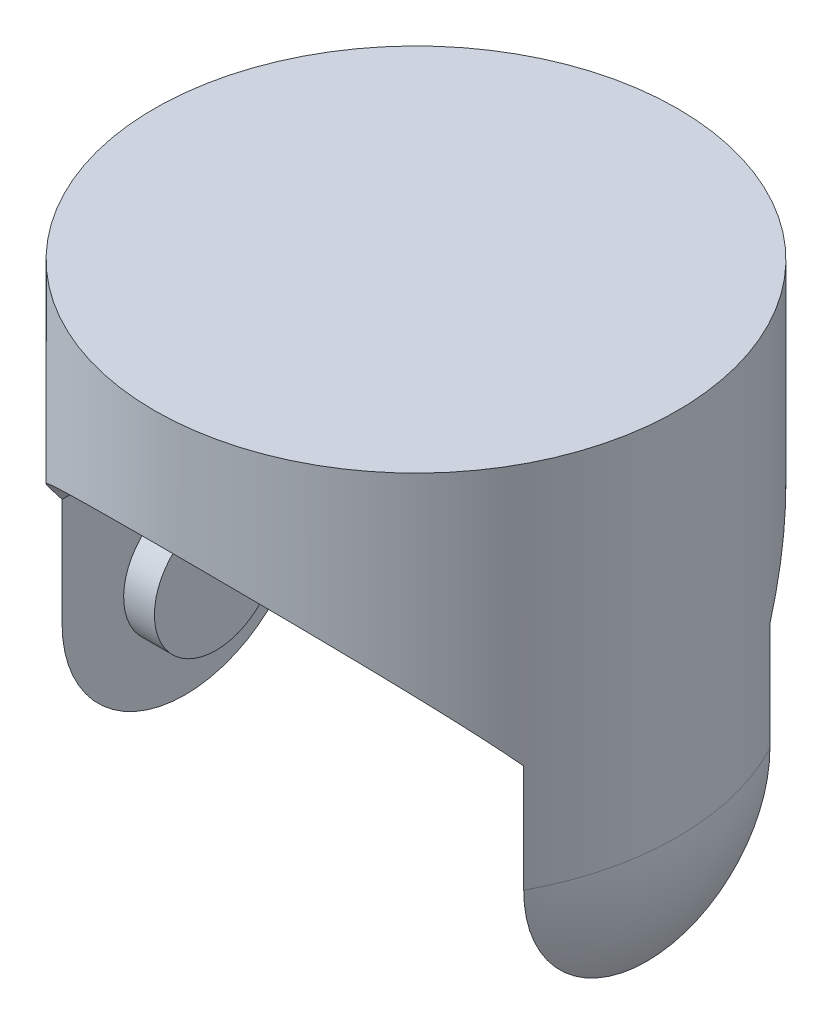
ISO-10303-21;
HEADER;
FILE_DESCRIPTION(('STEP AP214'),'2;1');
FILE_NAME('part.step','',(''),(''),'','','');
FILE_SCHEMA(('AUTOMOTIVE_DESIGN { 1 0 10303 214 1 1 1 1 }'));
ENDSEC;
DATA;
#1=APPLICATION_CONTEXT('core data for automotive mechanical design processes');
#2=APPLICATION_PROTOCOL_DEFINITION('international standard','automotive_design',2000,#1);
#3=PRODUCT_CONTEXT('',#1,'mechanical');
#4=PRODUCT('Part','Part','',(#3));
#5=PRODUCT_RELATED_PRODUCT_CATEGORY('part','',(#4));
#6=PRODUCT_DEFINITION_FORMATION('','',#4);
#7=PRODUCT_DEFINITION_CONTEXT('part definition',#1,'design');
#8=PRODUCT_DEFINITION('design','',#6,#7);
#9=PRODUCT_DEFINITION_SHAPE('','',#8);
#10=(LENGTH_UNIT() NAMED_UNIT(*) SI_UNIT(.MILLI.,.METRE.));
#11=(NAMED_UNIT(*) PLANE_ANGLE_UNIT() SI_UNIT($,.RADIAN.));
#12=(NAMED_UNIT(*) SI_UNIT($,.STERADIAN.) SOLID_ANGLE_UNIT());
#13=UNCERTAINTY_MEASURE_WITH_UNIT(LENGTH_MEASURE(1.E-05),#10,'distance_accuracy_value','');
#14=(GEOMETRIC_REPRESENTATION_CONTEXT(3) GLOBAL_UNCERTAINTY_ASSIGNED_CONTEXT((#13)) GLOBAL_UNIT_ASSIGNED_CONTEXT((#10,
#11,#12)) REPRESENTATION_CONTEXT('',''));
#15=CARTESIAN_POINT('',(0.,0.,0.));
#16=DIRECTION('',(0.,0.,1.));
#17=DIRECTION('',(1.,0.,0.));
#18=AXIS2_PLACEMENT_3D('',#15,#16,#17);
#19=CARTESIAN_POINT('',(0.,-304.8,0.));
#20=DIRECTION('',(0.,1.,0.));
#21=DIRECTION('',(1.,0.,0.));
#22=AXIS2_PLACEMENT_3D('',#19,#20,#21);
#23=SPHERICAL_SURFACE('',#22,215.9);
#24=CARTESIAN_POINT('',(0.,-304.8,0.));
#25=DIRECTION('',(0.,1.,0.));
#26=DIRECTION('',(0.,0.,1.));
#27=AXIS2_PLACEMENT_3D('',#24,#25,#26);
#28=CIRCLE('',#27,215.9);
#29=CARTESIAN_POINT('',(190.5,-304.8,101.6));
#30=VERTEX_POINT('',#29);
#31=CARTESIAN_POINT('',(190.5,-304.8,-101.6));
#32=VERTEX_POINT('',#31);
#33=EDGE_CURVE('E143',#30,#32,#28,.T.);
#34=ORIENTED_EDGE('',*,*,#33,.F.);
#35=CARTESIAN_POINT('',(190.5,-304.8,0.));
#36=DIRECTION('',(1.,0.,0.));
#37=DIRECTION('',(0.,1.,0.));
#38=AXIS2_PLACEMENT_3D('',#35,#36,#37);
#39=CIRCLE('',#38,101.6);
#40=EDGE_CURVE('E109',#30,#32,#39,.T.);
#41=ORIENTED_EDGE('',*,*,#40,.T.);
#42=EDGE_LOOP('',(#34,#41));
#43=FACE_BOUND('',#42,.T.);
#44=ADVANCED_FACE('F43',(#43),#23,.T.);
#45=CARTESIAN_POINT('',(0.,0.,0.));
#46=DIRECTION('',(0.,-1.,0.));
#47=DIRECTION('',(0.,0.,-1.));
#48=AXIS2_PLACEMENT_3D('',#45,#46,#47);
#49=PLANE('',#48);
#50=CARTESIAN_POINT('',(0.,0.,0.));
#51=DIRECTION('',(0.,1.,0.));
#52=DIRECTION('',(0.,0.,1.));
#53=AXIS2_PLACEMENT_3D('',#50,#51,#52);
#54=CIRCLE('',#53,215.9);
#55=CARTESIAN_POINT('',(0.,0.,215.9));
#56=VERTEX_POINT('',#55);
#57=EDGE_CURVE('E146',#56,#56,#54,.T.);
#58=ORIENTED_EDGE('',*,*,#57,.T.);
#59=EDGE_LOOP('',(#58));
#60=FACE_BOUND('',#59,.T.);
#61=ADVANCED_FACE('F45',(#60),#49,.F.);
#62=CARTESIAN_POINT('',(0.,0.,0.));
#63=DIRECTION('',(0.,1.,0.));
#64=DIRECTION('',(0.,0.,1.));
#65=AXIS2_PLACEMENT_3D('',#62,#63,#64);
#66=CYLINDRICAL_SURFACE('',#65,215.9);
#67=ORIENTED_EDGE('',*,*,#57,.F.);
#68=EDGE_LOOP('',(#67));
#69=FACE_BOUND('',#68,.T.);
#70=DIRECTION('',(0.,1.,0.));
#71=VECTOR('',#70,1.);
#72=CARTESIAN_POINT('',(190.5,0.,-101.6));
#73=LINE('',#72,#71);
#74=CARTESIAN_POINT('',(190.5,-215.9,-101.6));
#75=VERTEX_POINT('',#74);
#76=EDGE_CURVE('E67',#32,#75,#73,.T.);
#77=ORIENTED_EDGE('',*,*,#76,.T.);
#78=CARTESIAN_POINT('',(190.5,-215.9,-101.6));
#79=CARTESIAN_POINT('',(189.766105012446,-214.327419387753,-102.976078677435));
#80=CARTESIAN_POINT('',(189.012875308582,-212.764120839874,-104.352451212613));
#81=CARTESIAN_POINT('',(187.467454406698,-209.655748436745,-107.103930430533));
#82=CARTESIAN_POINT('',(186.675262881782,-208.110674734539,-108.479037102556));
#83=CARTESIAN_POINT('',(185.051532889982,-205.038238973918,-111.226286695931));
#84=CARTESIAN_POINT('',(184.219989313758,-203.510879247657,-112.598429208109));
#85=CARTESIAN_POINT('',(182.517350233358,-200.474034287564,-115.337885980859));
#86=CARTESIAN_POINT('',(181.646254801187,-198.964549021199,-116.705200250216));
#87=CARTESIAN_POINT('',(178.968841537095,-194.45573594098,-120.804106697323));
#88=CARTESIAN_POINT('',(177.102207890882,-191.483269499822,-123.526193089228));
#89=CARTESIAN_POINT('',(173.205704042735,-185.612522287097,-128.932926050064));
#90=CARTESIAN_POINT('',(171.175839845724,-182.714238791656,-131.617573992021));
#91=CARTESIAN_POINT('',(166.924452653757,-176.961704769171,-136.970277259427));
#92=CARTESIAN_POINT('',(164.700939274254,-174.108386371143,-139.637756589881));
#93=CARTESIAN_POINT('',(160.07991313016,-168.487422816284,-144.912129917779));
#94=CARTESIAN_POINT('',(157.682393053519,-165.719781266716,-147.519021363136));
#95=CARTESIAN_POINT('',(152.71264217189,-160.28056760383,-152.657863354955));
#96=CARTESIAN_POINT('',(150.140588725465,-157.608902062478,-155.189886332651));
#97=CARTESIAN_POINT('',(144.816769308391,-152.36800646713,-160.169269142854));
#98=CARTESIAN_POINT('',(142.065025963136,-149.79876358209,-162.61663957513));
#99=CARTESIAN_POINT('',(137.404116174534,-145.679112456677,-166.549025769963));
#100=CARTESIAN_POINT('',(135.548719430193,-144.095241784798,-168.062978796792));
#101=CARTESIAN_POINT('',(131.762899885421,-140.976888566228,-171.047236588874));
#102=CARTESIAN_POINT('',(129.832480849721,-139.442403548336,-172.517543537839));
#103=CARTESIAN_POINT('',(125.89616342807,-136.426116821141,-175.410754387198));
#104=CARTESIAN_POINT('',(123.890260966336,-134.944317965092,-176.833655720047));
#105=CARTESIAN_POINT('',(119.803029529629,-132.037205931736,-179.627871190304));
#106=CARTESIAN_POINT('',(117.72170232229,-130.611891432315,-180.999186535132));
#107=CARTESIAN_POINT('',(113.491865647057,-127.826997279863,-183.680845929929));
#108=CARTESIAN_POINT('',(111.343642386042,-126.467187847443,-184.991402392454));
#109=CARTESIAN_POINT('',(106.973296195268,-123.811849323217,-187.552493448829));
#110=CARTESIAN_POINT('',(104.751181382418,-122.51631320976,-188.803034598664));
#111=CARTESIAN_POINT('',(100.233970296257,-119.993878171911,-191.239499325252));
#112=CARTESIAN_POINT('',(97.9388793346283,-118.766974269872,-192.425427587982));
#113=CARTESIAN_POINT('',(93.2770646734713,-116.386363631045,-194.727904771621));
#114=CARTESIAN_POINT('',(90.9103439083042,-115.232653901789,-195.844456528877));
#115=CARTESIAN_POINT('',(86.5207784722576,-113.195148243981,-197.817380722734));
#116=CARTESIAN_POINT('',(84.5088744491807,-112.299077472605,-198.685453408934));
#117=CARTESIAN_POINT('',(80.4388658106176,-110.56317807618,-200.367779861032));
#118=CARTESIAN_POINT('',(78.38076287525,-109.723347410254,-201.182035579862));
#119=CARTESIAN_POINT('',(74.2202382596469,-108.102770799943,-202.753818798851));
#120=CARTESIAN_POINT('',(72.1178191870331,-107.322021391476,-203.511349624905));
#121=CARTESIAN_POINT('',(67.8706853668916,-105.822358654973,-204.966873286372));
#122=CARTESIAN_POINT('',(65.7259703450539,-105.103445728139,-205.664865735493));
#123=CARTESIAN_POINT('',(61.3964240830851,-103.730117509782,-206.998601068843));
#124=CARTESIAN_POINT('',(59.2115860155476,-103.075713318103,-207.634333239993));
#125=CARTESIAN_POINT('',(54.8050851252008,-101.83423404657,-208.840682459609));
#126=CARTESIAN_POINT('',(52.583422394785,-101.247158797816,-209.411299671422));
#127=CARTESIAN_POINT('',(48.1065284453107,-100.142878315574,-210.484846774201));
#128=CARTESIAN_POINT('',(45.8512962997798,-99.6256750144446,-210.987774793174));
#129=CARTESIAN_POINT('',(41.3110369565704,-98.6635329300722,-211.923525199282));
#130=CARTESIAN_POINT('',(39.0260097214991,-98.2185942375303,-212.356347498427));
#131=CARTESIAN_POINT('',(34.4162817746728,-97.4006453166212,-213.152136575592));
#132=CARTESIAN_POINT('',(32.0914243548495,-97.0280886176759,-213.514662868596));
#133=CARTESIAN_POINT('',(27.4202024411604,-96.3601788757879,-214.16466358534));
#134=CARTESIAN_POINT('',(25.0738379249109,-96.0648259132054,-214.452137930961));
#135=CARTESIAN_POINT('',(20.3643864358205,-95.5528685199526,-214.950479395685));
#136=CARTESIAN_POINT('',(18.0012992079464,-95.3362652929216,-215.161345343878));
#137=CARTESIAN_POINT('',(13.2635103060288,-94.9829795011482,-215.50529103054));
#138=CARTESIAN_POINT('',(10.8888086566122,-94.8462967670193,-215.638370933872));
#139=CARTESIAN_POINT('',(6.13384958276646,-94.6536328840839,-215.825960276887));
#140=CARTESIAN_POINT('',(3.75359434982217,-94.5976239981173,-215.880496721262));
#141=CARTESIAN_POINT('',(-1.00796191617875,-94.5665289306093,-215.910774036426));
#142=CARTESIAN_POINT('',(-3.38926295515028,-94.5914432128059,-215.886514455667));
#143=CARTESIAN_POINT('',(-8.14737516027976,-94.7220521489779,-215.759342678407));
#144=CARTESIAN_POINT('',(-10.5241866172645,-94.8277413770947,-215.656435764847));
#145=CARTESIAN_POINT('',(-15.2681665382314,-95.1193132993761,-215.372559221236));
#146=CARTESIAN_POINT('',(-17.6353352122737,-95.3051942370971,-215.191591300959));
#147=CARTESIAN_POINT('',(-22.1142914435258,-95.7331430953827,-214.774995103797));
#148=CARTESIAN_POINT('',(-24.2275129562793,-95.9675514613056,-214.54681969637));
#149=CARTESIAN_POINT('',(-28.4384673296252,-96.4992150022938,-214.029351503725));
#150=CARTESIAN_POINT('',(-30.5362005230455,-96.7964688227837,-213.740060035806));
#151=CARTESIAN_POINT('',(-34.7126335818561,-97.4525595303778,-213.101631517365));
#152=CARTESIAN_POINT('',(-36.7913350821662,-97.8113910743495,-212.752499659229));
#153=CARTESIAN_POINT('',(-40.9267327505185,-98.5892116216915,-211.995828097755));
#154=CARTESIAN_POINT('',(-42.9834287768674,-99.008201012168,-211.58828801857));
#155=CARTESIAN_POINT('',(-47.0719749103045,-99.9047353167661,-210.716417456946));
#156=CARTESIAN_POINT('',(-49.1038236169758,-100.38228351474,-210.25208378965));
#157=CARTESIAN_POINT('',(-53.1398620364577,-101.394140972513,-209.26843864519));
#158=CARTESIAN_POINT('',(-55.1440518338936,-101.928450058604,-208.749127336279));
#159=CARTESIAN_POINT('',(-59.122358826226,-103.051941673484,-207.657437687473));
#160=CARTESIAN_POINT('',(-61.0964759158408,-103.64112439433,-207.085059161845));
#161=CARTESIAN_POINT('',(-65.0126305526759,-104.872434466398,-205.889193383961));
#162=CARTESIAN_POINT('',(-66.9546652589811,-105.514566476467,-205.265701634435));
#163=CARTESIAN_POINT('',(-70.9114489794199,-106.88675864269,-203.933745148264));
#164=CARTESIAN_POINT('',(-72.9242504598063,-107.619721026607,-203.222484786116));
#165=CARTESIAN_POINT('',(-76.9100221011801,-109.139941474559,-201.747799020238));
#166=CARTESIAN_POINT('',(-78.8829887339229,-109.927204321049,-200.984369021779));
#167=CARTESIAN_POINT('',(-82.7871219738265,-111.553464411038,-199.407957707705));
#168=CARTESIAN_POINT('',(-84.7182924028167,-112.392456897165,-198.594980948789));
#169=CARTESIAN_POINT('',(-88.5377124375049,-114.119828882018,-196.921891999681));
#170=CARTESIAN_POINT('',(-90.4259588237995,-115.008212068056,-196.061776290352));
#171=CARTESIAN_POINT('',(-96.025261206568,-117.744212751115,-193.414078856215));
#172=CARTESIAN_POINT('',(-99.6705376829344,-119.662537946493,-191.559285906779));
#173=CARTESIAN_POINT('',(-106.778384618706,-123.668868693387,-187.690081240967));
#174=CARTESIAN_POINT('',(-110.240932383546,-125.756895240076,-185.675649775145));
#175=CARTESIAN_POINT('',(-116.232170525311,-129.605101354248,-181.968126722272));
#176=CARTESIAN_POINT('',(-118.797599871686,-131.3352270008,-180.302909644965));
#177=CARTESIAN_POINT('',(-123.815738391421,-134.880719646533,-176.894526091753));
#178=CARTESIAN_POINT('',(-126.268436207798,-136.696095197016,-175.151351796907));
#179=CARTESIAN_POINT('',(-131.06189897774,-140.405876846065,-171.593999426554));
#180=CARTESIAN_POINT('',(-133.402617824649,-142.300314907157,-169.779792653504));
#181=CARTESIAN_POINT('',(-137.9716686207,-146.161340050896,-166.088093063909));
#182=CARTESIAN_POINT('',(-140.200003756255,-148.127925085227,-164.210602044183));
#183=CARTESIAN_POINT('',(-144.55154739696,-152.133434931293,-160.393455514123));
#184=CARTESIAN_POINT('',(-146.674439974505,-154.172549012086,-158.453638864286));
#185=CARTESIAN_POINT('',(-150.809644557611,-158.312894881864,-154.523132558282));
#186=CARTESIAN_POINT('',(-152.821954769323,-160.414127677681,-152.532442077614));
#187=CARTESIAN_POINT('',(-156.736946890442,-164.673787510732,-148.506635791285));
#188=CARTESIAN_POINT('',(-158.639656812875,-166.832199725576,-146.471531522472));
#189=CARTESIAN_POINT('',(-162.337489014,-171.202869075907,-142.362178173668));
#190=CARTESIAN_POINT('',(-164.132615098684,-173.415124302693,-140.287930481872));
#191=CARTESIAN_POINT('',(-168.348115621762,-178.829438294344,-135.228144689703));
#192=CARTESIAN_POINT('',(-170.714809607163,-182.057342095673,-132.225408442319));
#193=CARTESIAN_POINT('',(-175.239236714687,-188.608278139995,-126.167776131336));
#194=CARTESIAN_POINT('',(-177.396991458551,-191.931300493589,-123.112885503416));
#195=CARTESIAN_POINT('',(-180.472496468409,-196.971565782695,-118.515208656107));
#196=CARTESIAN_POINT('',(-181.467354400782,-198.654486332481,-116.985894439612));
#197=CARTESIAN_POINT('',(-183.407260925124,-202.042772922448,-113.920482888558));
#198=CARTESIAN_POINT('',(-184.352309522892,-203.748138960014,-112.384385554789));
#199=CARTESIAN_POINT('',(-186.192993184731,-207.181232508169,-109.307785352026));
#200=CARTESIAN_POINT('',(-187.088630445466,-208.908959020461,-107.767282682088));
#201=CARTESIAN_POINT('',(-188.830936491872,-212.387246025865,-104.684404046828));
#202=CARTESIAN_POINT('',(-189.677605773974,-214.13780628727,-103.142028100658));
#203=CARTESIAN_POINT('',(-190.5,-215.9,-101.6));
#204=B_SPLINE_CURVE_WITH_KNOTS('',3,(#78,#79,#80,#81,#82,#83,#84,#85,#86,#87,#88,#89,#90,#91,
#92,#93,#94,#95,#96,#97,#98,#99,#100,#101,#102,#103,#104,#105,#106,#107,#108,#109,#110,#111,
#112,#113,#114,#115,#116,#117,#118,#119,#120,#121,#122,#123,#124,#125,#126,#127,#128,#129,#130,
#131,#132,#133,#134,#135,#136,#137,#138,#139,#140,#141,#142,#143,#144,#145,#146,#147,#148,#149,
#150,#151,#152,#153,#154,#155,#156,#157,#158,#159,#160,#161,#162,#163,#164,#165,#166,#167,#168,
#169,#170,#171,#172,#173,#174,#175,#176,#177,#178,#179,#180,#181,#182,#183,#184,#185,#186,#187,
#188,#189,#190,#191,#192,#193,#194,#195,#196,#197,#198,#199,#200,#201,#202,#203),.UNSPECIFIED.,
.F.,.F.,(4,2,2,2,2,2,2,2,2,2,2,2,2,2,2,2,2,2,2,2,2,2,2,2,2,2,2,2,2,2,2,2,2,2,2,2,2,2,2,2,2,2,2,
2,2,2,2,2,2,2,2,2,2,2,2,2,2,2,2,2,2,2,4),(0.,6.64420077569806,13.2884573066118,19.9335788852977,
26.5786883670947,39.9001324894869,53.2210867667946,66.7002904233227,80.1800608267129,
93.6463326629028,107.110912170236,115.722673891562,124.334004018294,132.945799789267,
141.557393866994,150.136174690277,158.714016236592,167.291234854158,175.868102574754,
182.968468448874,190.068576520575,197.16826797212,204.26800548381,211.368962503581,
218.469901709672,225.57103725719,232.672181717476,239.816478785031,246.960783288948,
254.105196984395,261.249595537634,268.39153712777,275.533519645568,282.675022460405,
289.816368862444,296.229709497367,302.642911912784,309.055558132256,315.468245617932,
321.881292877905,328.29432051215,334.707370592634,341.120985541208,347.890611131113,
354.660833711739,361.430434587655,368.200541535312,381.741942941588,395.285022225618,
405.823128508233,416.362294121299,426.905762466923,437.448931705499,448.021989394283,
458.595218546968,469.165733158191,479.735873595348,494.740972614213,509.744517191447,
517.190283563108,524.636049067942,532.081483291608,539.526842021249),.UNSPECIFIED.);
#205=CARTESIAN_POINT('',(-190.5,-215.9,-101.6));
#206=VERTEX_POINT('',#205);
#207=EDGE_CURVE('E52',#75,#206,#204,.T.);
#208=ORIENTED_EDGE('',*,*,#207,.T.);
#209=DIRECTION('',(0.,1.,0.));
#210=VECTOR('',#209,1.);
#211=CARTESIAN_POINT('',(-190.5,0.,-101.6));
#212=LINE('',#211,#210);
#213=CARTESIAN_POINT('',(-190.5,-304.8,-101.6));
#214=VERTEX_POINT('',#213);
#215=EDGE_CURVE('E85',#206,#214,#212,.F.);
#216=ORIENTED_EDGE('',*,*,#215,.T.);
#217=CARTESIAN_POINT('',(-190.5,-304.8,101.6));
#218=VERTEX_POINT('',#217);
#219=EDGE_CURVE('E147',#214,#218,#28,.T.);
#220=ORIENTED_EDGE('',*,*,#219,.T.);
#221=DIRECTION('',(0.,1.,0.));
#222=VECTOR('',#221,1.);
#223=CARTESIAN_POINT('',(-190.5,0.,101.6));
#224=LINE('',#223,#222);
#225=CARTESIAN_POINT('',(-190.5,-215.9,101.6));
#226=VERTEX_POINT('',#225);
#227=EDGE_CURVE('E59',#218,#226,#224,.T.);
#228=ORIENTED_EDGE('',*,*,#227,.T.);
#229=CARTESIAN_POINT('',(-190.5,-215.9,101.6));
#230=CARTESIAN_POINT('',(-189.766105012446,-214.327419387753,102.976078677435));
#231=CARTESIAN_POINT('',(-189.012875308582,-212.764120839874,104.352451212613));
#232=CARTESIAN_POINT('',(-187.467454406698,-209.655748436746,107.103930430533));
#233=CARTESIAN_POINT('',(-186.675262881782,-208.110674734539,108.479037102556));
#234=CARTESIAN_POINT('',(-185.051532889982,-205.038238973918,111.226286695931));
#235=CARTESIAN_POINT('',(-184.219989313758,-203.510879247657,112.598429208109));
#236=CARTESIAN_POINT('',(-182.517350233358,-200.474034287564,115.33788598086));
#237=CARTESIAN_POINT('',(-181.646254801186,-198.964549021199,116.705200250216));
#238=CARTESIAN_POINT('',(-178.968841537095,-194.45573594098,120.804106697323));
#239=CARTESIAN_POINT('',(-177.102207890882,-191.483269499822,123.526193089228));
#240=CARTESIAN_POINT('',(-173.205704042735,-185.612522287098,128.932926050064));
#241=CARTESIAN_POINT('',(-171.175839845724,-182.714238791656,131.617573992021));
#242=CARTESIAN_POINT('',(-166.924452653757,-176.961704769171,136.970277259427));
#243=CARTESIAN_POINT('',(-164.700939274254,-174.108386371143,139.637756589881));
#244=CARTESIAN_POINT('',(-160.07991313016,-168.487422816284,144.912129917779));
#245=CARTESIAN_POINT('',(-157.682393053519,-165.719781266716,147.519021363136));
#246=CARTESIAN_POINT('',(-152.71264217189,-160.28056760383,152.657863354955));
#247=CARTESIAN_POINT('',(-150.140588725465,-157.608902062478,155.189886332651));
#248=CARTESIAN_POINT('',(-144.816769308391,-152.36800646713,160.169269142854));
#249=CARTESIAN_POINT('',(-142.065025963136,-149.79876358209,162.61663957513));
#250=CARTESIAN_POINT('',(-137.404116174534,-145.679112456677,166.549025769963));
#251=CARTESIAN_POINT('',(-135.548719430193,-144.095241784798,168.062978796792));
#252=CARTESIAN_POINT('',(-131.762899885421,-140.976888566228,171.047236588874));
#253=CARTESIAN_POINT('',(-129.832480849721,-139.442403548336,172.517543537839));
#254=CARTESIAN_POINT('',(-125.89616342807,-136.426116821141,175.410754387198));
#255=CARTESIAN_POINT('',(-123.890260966336,-134.944317965092,176.833655720047));
#256=CARTESIAN_POINT('',(-119.803029529629,-132.037205931736,179.627871190304));
#257=CARTESIAN_POINT('',(-117.72170232229,-130.611891432315,180.999186535132));
#258=CARTESIAN_POINT('',(-113.491865647057,-127.826997279863,183.680845929929));
#259=CARTESIAN_POINT('',(-111.343642386042,-126.467187847443,184.991402392455));
#260=CARTESIAN_POINT('',(-106.973296195268,-123.811849323217,187.552493448829));
#261=CARTESIAN_POINT('',(-104.751181382418,-122.51631320976,188.803034598664));
#262=CARTESIAN_POINT('',(-100.233970296257,-119.993878171911,191.239499325252));
#263=CARTESIAN_POINT('',(-97.9388793346283,-118.766974269872,192.425427587982));
#264=CARTESIAN_POINT('',(-93.2770646734713,-116.386363631045,194.727904771621));
#265=CARTESIAN_POINT('',(-90.9103439083042,-115.232653901789,195.844456528877));
#266=CARTESIAN_POINT('',(-86.5207784722576,-113.195148243981,197.817380722734));
#267=CARTESIAN_POINT('',(-84.5088744491807,-112.299077472605,198.685453408934));
#268=CARTESIAN_POINT('',(-80.4388658106176,-110.56317807618,200.367779861032));
#269=CARTESIAN_POINT('',(-78.38076287525,-109.723347410254,201.182035579862));
#270=CARTESIAN_POINT('',(-74.2202382596469,-108.102770799943,202.753818798851));
#271=CARTESIAN_POINT('',(-72.1178191870331,-107.322021391476,203.511349624905));
#272=CARTESIAN_POINT('',(-67.8706853668916,-105.822358654973,204.966873286372));
#273=CARTESIAN_POINT('',(-65.7259703450539,-105.103445728139,205.664865735493));
#274=CARTESIAN_POINT('',(-61.3964240830851,-103.730117509782,206.998601068843));
#275=CARTESIAN_POINT('',(-59.2115860155476,-103.075713318103,207.634333239993));
#276=CARTESIAN_POINT('',(-54.8050851252008,-101.83423404657,208.840682459609));
#277=CARTESIAN_POINT('',(-52.583422394785,-101.247158797816,209.411299671422));
#278=CARTESIAN_POINT('',(-48.1065284453107,-100.142878315574,210.484846774201));
#279=CARTESIAN_POINT('',(-45.8512962997798,-99.6256750144446,210.987774793174));
#280=CARTESIAN_POINT('',(-41.3110369565704,-98.6635329300723,211.923525199282));
#281=CARTESIAN_POINT('',(-39.0260097214991,-98.2185942375303,212.356347498427));
#282=CARTESIAN_POINT('',(-34.4162817746728,-97.4006453166212,213.152136575592));
#283=CARTESIAN_POINT('',(-32.0914243548495,-97.0280886176759,213.514662868596));
#284=CARTESIAN_POINT('',(-27.4202024411604,-96.3601788757879,214.16466358534));
#285=CARTESIAN_POINT('',(-25.0738379249109,-96.0648259132054,214.452137930961));
#286=CARTESIAN_POINT('',(-20.3643864358205,-95.5528685199526,214.950479395685));
#287=CARTESIAN_POINT('',(-18.0012992079463,-95.3362652929216,215.161345343878));
#288=CARTESIAN_POINT('',(-13.2635103060288,-94.9829795011482,215.50529103054));
#289=CARTESIAN_POINT('',(-10.8888086566122,-94.8462967670193,215.638370933872));
#290=CARTESIAN_POINT('',(-6.13384958276644,-94.6536328840839,215.825960276887));
#291=CARTESIAN_POINT('',(-3.75359434982216,-94.5976239981173,215.880496721262));
#292=CARTESIAN_POINT('',(1.00796191617876,-94.5665289306093,215.910774036426));
#293=CARTESIAN_POINT('',(3.38926295515029,-94.5914432128059,215.886514455667));
#294=CARTESIAN_POINT('',(8.14737516027976,-94.7220521489778,215.759342678407));
#295=CARTESIAN_POINT('',(10.5241866172645,-94.8277413770948,215.656435764847));
#296=CARTESIAN_POINT('',(15.2681665382314,-95.1193132993761,215.372559221236));
#297=CARTESIAN_POINT('',(17.6353352122737,-95.3051942370971,215.191591300959));
#298=CARTESIAN_POINT('',(22.1142914435258,-95.7331430953827,214.774995103797));
#299=CARTESIAN_POINT('',(24.2275129562794,-95.9675514613056,214.54681969637));
#300=CARTESIAN_POINT('',(28.4384673296252,-96.4992150022939,214.029351503725));
#301=CARTESIAN_POINT('',(30.5362005230455,-96.7964688227837,213.740060035806));
#302=CARTESIAN_POINT('',(34.7126335818561,-97.4525595303778,213.101631517365));
#303=CARTESIAN_POINT('',(36.7913350821663,-97.8113910743495,212.752499659229));
#304=CARTESIAN_POINT('',(40.9267327505185,-98.5892116216915,211.995828097755));
#305=CARTESIAN_POINT('',(42.9834287768674,-99.008201012168,211.58828801857));
#306=CARTESIAN_POINT('',(47.0719749103046,-99.9047353167661,210.716417456946));
#307=CARTESIAN_POINT('',(49.1038236169758,-100.38228351474,210.25208378965));
#308=CARTESIAN_POINT('',(53.1398620364577,-101.394140972513,209.26843864519));
#309=CARTESIAN_POINT('',(55.1440518338936,-101.928450058604,208.749127336279));
#310=CARTESIAN_POINT('',(59.122358826226,-103.051941673484,207.657437687473));
#311=CARTESIAN_POINT('',(61.0964759158408,-103.64112439433,207.085059161845));
#312=CARTESIAN_POINT('',(65.0126305526759,-104.872434466398,205.889193383961));
#313=CARTESIAN_POINT('',(66.9546652589811,-105.514566476467,205.265701634435));
#314=CARTESIAN_POINT('',(70.9114489794199,-106.88675864269,203.933745148264));
#315=CARTESIAN_POINT('',(72.9242504598063,-107.619721026607,203.222484786116));
#316=CARTESIAN_POINT('',(76.9100221011801,-109.139941474559,201.747799020238));
#317=CARTESIAN_POINT('',(78.8829887339229,-109.927204321049,200.984369021779));
#318=CARTESIAN_POINT('',(82.7871219738265,-111.553464411038,199.407957707705));
#319=CARTESIAN_POINT('',(84.7182924028167,-112.392456897165,198.594980948789));
#320=CARTESIAN_POINT('',(88.5377124375049,-114.119828882018,196.921891999681));
#321=CARTESIAN_POINT('',(90.4259588237995,-115.008212068056,196.061776290352));
#322=CARTESIAN_POINT('',(96.025261206568,-117.744212751115,193.414078856215));
#323=CARTESIAN_POINT('',(99.6705376829344,-119.662537946493,191.559285906779));
#324=CARTESIAN_POINT('',(106.778384618706,-123.668868693387,187.690081240967));
#325=CARTESIAN_POINT('',(110.240932383546,-125.756895240076,185.675649775145));
#326=CARTESIAN_POINT('',(116.232170525311,-129.605101354248,181.968126722272));
#327=CARTESIAN_POINT('',(118.797599871686,-131.3352270008,180.302909644965));
#328=CARTESIAN_POINT('',(123.815738391421,-134.880719646533,176.894526091753));
#329=CARTESIAN_POINT('',(126.268436207798,-136.696095197016,175.151351796907));
#330=CARTESIAN_POINT('',(131.06189897774,-140.405876846065,171.593999426554));
#331=CARTESIAN_POINT('',(133.402617824649,-142.300314907157,169.779792653504));
#332=CARTESIAN_POINT('',(137.9716686207,-146.161340050896,166.088093063909));
#333=CARTESIAN_POINT('',(140.200003756255,-148.127925085227,164.210602044183));
#334=CARTESIAN_POINT('',(144.55154739696,-152.133434931293,160.393455514123));
#335=CARTESIAN_POINT('',(146.674439974505,-154.172549012086,158.453638864286));
#336=CARTESIAN_POINT('',(150.809644557611,-158.312894881864,154.523132558282));
#337=CARTESIAN_POINT('',(152.821954769323,-160.414127677681,152.532442077614));
#338=CARTESIAN_POINT('',(156.736946890442,-164.673787510732,148.506635791285));
#339=CARTESIAN_POINT('',(158.639656812875,-166.832199725576,146.471531522472));
#340=CARTESIAN_POINT('',(162.337489014,-171.202869075907,142.362178173668));
#341=CARTESIAN_POINT('',(164.132615098684,-173.415124302693,140.287930481872));
#342=CARTESIAN_POINT('',(168.348115621762,-178.829438294343,135.228144689703));
#343=CARTESIAN_POINT('',(170.714809607163,-182.057342095672,132.225408442319));
#344=CARTESIAN_POINT('',(175.239236714687,-188.608278139994,126.167776131336));
#345=CARTESIAN_POINT('',(177.396991458551,-191.931300493589,123.112885503416));
#346=CARTESIAN_POINT('',(180.47249646841,-196.971565782695,118.515208656107));
#347=CARTESIAN_POINT('',(181.467354400783,-198.654486332481,116.985894439612));
#348=CARTESIAN_POINT('',(183.407260925124,-202.042772922447,113.920482888558));
#349=CARTESIAN_POINT('',(184.352309522892,-203.748138960014,112.384385554789));
#350=CARTESIAN_POINT('',(186.192993184731,-207.181232508168,109.307785352026));
#351=CARTESIAN_POINT('',(187.088630445466,-208.908959020461,107.767282682088));
#352=CARTESIAN_POINT('',(188.830936491872,-212.387246025864,104.684404046828));
#353=CARTESIAN_POINT('',(189.677605773974,-214.13780628727,103.142028100658));
#354=CARTESIAN_POINT('',(190.5,-215.9,101.6));
#355=B_SPLINE_CURVE_WITH_KNOTS('',3,(#229,#230,#231,#232,#233,#234,#235,#236,#237,#238,#239,
#240,#241,#242,#243,#244,#245,#246,#247,#248,#249,#250,#251,#252,#253,#254,#255,#256,#257,#258,
#259,#260,#261,#262,#263,#264,#265,#266,#267,#268,#269,#270,#271,#272,#273,#274,#275,#276,#277,
#278,#279,#280,#281,#282,#283,#284,#285,#286,#287,#288,#289,#290,#291,#292,#293,#294,#295,#296,
#297,#298,#299,#300,#301,#302,#303,#304,#305,#306,#307,#308,#309,#310,#311,#312,#313,#314,#315,
#316,#317,#318,#319,#320,#321,#322,#323,#324,#325,#326,#327,#328,#329,#330,#331,#332,#333,#334,
#335,#336,#337,#338,#339,#340,#341,#342,#343,#344,#345,#346,#347,#348,#349,#350,#351,#352,#353,
#354),.UNSPECIFIED.,.F.,.F.,(4,2,2,2,2,2,2,2,2,2,2,2,2,2,2,2,2,2,2,2,2,2,2,2,2,2,2,2,2,2,2,2,2,
2,2,2,2,2,2,2,2,2,2,2,2,2,2,2,2,2,2,2,2,2,2,2,2,2,2,2,2,2,4),(0.,6.64420077569807,
13.2884573066118,19.9335788852977,26.5786883670947,39.9001324894868,53.2210867667946,
66.7002904233227,80.1800608267128,93.6463326629027,107.110912170236,115.722673891562,
124.334004018294,132.945799789267,141.557393866994,150.136174690277,158.714016236592,
167.291234854158,175.868102574754,182.968468448874,190.068576520575,197.16826797212,
204.26800548381,211.368962503581,218.469901709672,225.57103725719,232.672181717476,
239.816478785031,246.960783288948,254.105196984395,261.249595537634,268.39153712777,
275.533519645568,282.675022460404,289.816368862444,296.229709497367,302.642911912784,
309.055558132256,315.468245617932,321.881292877905,328.29432051215,334.707370592634,
341.120985541208,347.890611131113,354.660833711739,361.430434587655,368.200541535312,
381.741942941587,395.285022225618,405.823128508233,416.362294121298,426.905762466923,
437.448931705499,448.021989394283,458.595218546968,469.16573315819,479.735873595348,
494.740972614213,509.744517191447,517.190283563107,524.636049067942,532.081483291608,
539.526842021249),.UNSPECIFIED.);
#356=CARTESIAN_POINT('',(190.5,-215.9,101.6));
#357=VERTEX_POINT('',#356);
#358=EDGE_CURVE('E101',#226,#357,#355,.T.);
#359=ORIENTED_EDGE('',*,*,#358,.T.);
#360=DIRECTION('',(0.,1.,0.));
#361=VECTOR('',#360,1.);
#362=CARTESIAN_POINT('',(190.5,0.,101.6));
#363=LINE('',#362,#361);
#364=EDGE_CURVE('E159',#357,#30,#363,.F.);
#365=ORIENTED_EDGE('',*,*,#364,.T.);
#366=ORIENTED_EDGE('',*,*,#33,.T.);
#367=EDGE_LOOP('',(#77,#208,#216,#220,#228,#359,#365,#366));
#368=FACE_BOUND('',#367,.T.);
#369=ADVANCED_FACE('F105',(#69,#368),#66,.T.);
#370=ORIENTED_EDGE('',*,*,#219,.F.);
#371=CARTESIAN_POINT('',(-190.5,-304.8,0.));
#372=DIRECTION('',(-1.,0.,0.));
#373=DIRECTION('',(0.,-1.,0.));
#374=AXIS2_PLACEMENT_3D('',#371,#372,#373);
#375=CIRCLE('',#374,101.6);
#376=EDGE_CURVE('E89',#214,#218,#375,.T.);
#377=ORIENTED_EDGE('',*,*,#376,.T.);
#378=EDGE_LOOP('',(#370,#377));
#379=FACE_BOUND('',#378,.T.);
#380=ADVANCED_FACE('F127',(#379),#23,.T.);
#381=CARTESIAN_POINT('',(0.,-304.8,-215.9));
#382=DIRECTION('',(0.,0.,1.));
#383=DIRECTION('',(1.,0.,0.));
#384=AXIS2_PLACEMENT_3D('',#381,#382,#383);
#385=CYLINDRICAL_SURFACE('',#384,210.222406037035);
#386=DIRECTION('',(0.,0.,1.));
#387=VECTOR('',#386,1.);
#388=CARTESIAN_POINT('',(-190.5,-215.9,-215.9));
#389=LINE('',#388,#387);
#390=EDGE_CURVE('E88',#206,#226,#389,.T.);
#391=ORIENTED_EDGE('',*,*,#390,.F.);
#392=ORIENTED_EDGE('',*,*,#207,.F.);
#393=DIRECTION('',(0.,0.,1.));
#394=VECTOR('',#393,1.);
#395=CARTESIAN_POINT('',(190.5,-215.9,-215.9));
#396=LINE('',#395,#394);
#397=EDGE_CURVE('E95',#75,#357,#396,.T.);
#398=ORIENTED_EDGE('',*,*,#397,.T.);
#399=ORIENTED_EDGE('',*,*,#358,.F.);
#400=EDGE_LOOP('',(#391,#392,#398,#399));
#401=FACE_BOUND('',#400,.T.);
#402=ADVANCED_FACE('F98',(#401),#385,.F.);
#403=CARTESIAN_POINT('',(190.5,-215.9,-215.9));
#404=DIRECTION('',(1.,0.,0.));
#405=DIRECTION('',(0.,1.,0.));
#406=AXIS2_PLACEMENT_3D('',#403,#404,#405);
#407=PLANE('',#406);
#408=CARTESIAN_POINT('',(190.5,-311.15,0.));
#409=DIRECTION('',(1.,0.,0.));
#410=DIRECTION('',(0.,1.,0.));
#411=AXIS2_PLACEMENT_3D('',#408,#409,#410);
#412=CIRCLE('',#411,50.8);
#413=CARTESIAN_POINT('',(190.5,-260.35,0.));
#414=VERTEX_POINT('',#413);
#415=EDGE_CURVE('E169',#414,#414,#412,.T.);
#416=ORIENTED_EDGE('',*,*,#415,.T.);
#417=EDGE_LOOP('',(#416));
#418=FACE_BOUND('',#417,.T.);
#419=ORIENTED_EDGE('',*,*,#40,.F.);
#420=ORIENTED_EDGE('',*,*,#364,.F.);
#421=ORIENTED_EDGE('',*,*,#397,.F.);
#422=ORIENTED_EDGE('',*,*,#76,.F.);
#423=EDGE_LOOP('',(#419,#420,#421,#422));
#424=FACE_BOUND('',#423,.T.);
#425=ADVANCED_FACE('F126',(#418,#424),#407,.F.);
#426=CARTESIAN_POINT('',(-190.5,-215.9,-215.9));
#427=DIRECTION('',(-1.,0.,0.));
#428=DIRECTION('',(0.,-1.,0.));
#429=AXIS2_PLACEMENT_3D('',#426,#427,#428);
#430=PLANE('',#429);
#431=CARTESIAN_POINT('',(-190.5,-311.15,0.));
#432=DIRECTION('',(-1.,0.,0.));
#433=DIRECTION('',(0.,-1.,0.));
#434=AXIS2_PLACEMENT_3D('',#431,#432,#433);
#435=CIRCLE('',#434,50.8);
#436=CARTESIAN_POINT('',(-190.5,-361.95,0.));
#437=VERTEX_POINT('',#436);
#438=EDGE_CURVE('E11',#437,#437,#435,.F.);
#439=ORIENTED_EDGE('',*,*,#438,.F.);
#440=EDGE_LOOP('',(#439));
#441=FACE_BOUND('',#440,.T.);
#442=ORIENTED_EDGE('',*,*,#376,.F.);
#443=ORIENTED_EDGE('',*,*,#215,.F.);
#444=ORIENTED_EDGE('',*,*,#390,.T.);
#445=ORIENTED_EDGE('',*,*,#227,.F.);
#446=EDGE_LOOP('',(#442,#443,#444,#445));
#447=FACE_BOUND('',#446,.T.);
#448=ADVANCED_FACE('F87',(#441,#447),#430,.F.);
#449=CARTESIAN_POINT('',(-165.1,-311.15,0.));
#450=DIRECTION('',(-1.,0.,0.));
#451=DIRECTION('',(0.,-1.,0.));
#452=AXIS2_PLACEMENT_3D('',#449,#450,#451);
#453=CYLINDRICAL_SURFACE('',#452,50.8);
#454=CARTESIAN_POINT('',(-165.1,-311.15,0.));
#455=DIRECTION('',(1.,0.,0.));
#456=DIRECTION('',(0.,1.,0.));
#457=AXIS2_PLACEMENT_3D('',#454,#455,#456);
#458=CIRCLE('',#457,50.8);
#459=CARTESIAN_POINT('',(-165.1,-260.35,0.));
#460=VERTEX_POINT('',#459);
#461=EDGE_CURVE('E103',#460,#460,#458,.T.);
#462=ORIENTED_EDGE('',*,*,#461,.F.);
#463=EDGE_LOOP('',(#462));
#464=FACE_BOUND('',#463,.T.);
#465=ORIENTED_EDGE('',*,*,#438,.T.);
#466=EDGE_LOOP('',(#465));
#467=FACE_BOUND('',#466,.T.);
#468=ADVANCED_FACE('F191',(#464,#467),#453,.T.);
#469=CARTESIAN_POINT('',(-165.1,-311.15,0.));
#470=DIRECTION('',(1.,0.,0.));
#471=DIRECTION('',(0.,1.,0.));
#472=AXIS2_PLACEMENT_3D('',#469,#470,#471);
#473=PLANE('',#472);
#474=ORIENTED_EDGE('',*,*,#461,.T.);
#475=EDGE_LOOP('',(#474));
#476=FACE_BOUND('',#475,.T.);
#477=ADVANCED_FACE('F186',(#476),#473,.T.);
#478=CARTESIAN_POINT('',(165.1,-311.15,0.));
#479=DIRECTION('',(1.,0.,0.));
#480=DIRECTION('',(0.,1.,0.));
#481=AXIS2_PLACEMENT_3D('',#478,#479,#480);
#482=CYLINDRICAL_SURFACE('',#481,50.8);
#483=CARTESIAN_POINT('',(165.1,-311.15,0.));
#484=DIRECTION('',(1.,0.,0.));
#485=DIRECTION('',(0.,1.,0.));
#486=AXIS2_PLACEMENT_3D('',#483,#484,#485);
#487=CIRCLE('',#486,50.8);
#488=CARTESIAN_POINT('',(165.1,-260.35,0.));
#489=VERTEX_POINT('',#488);
#490=EDGE_CURVE('E168',#489,#489,#487,.T.);
#491=ORIENTED_EDGE('',*,*,#490,.T.);
#492=EDGE_LOOP('',(#491));
#493=FACE_BOUND('',#492,.T.);
#494=ORIENTED_EDGE('',*,*,#415,.F.);
#495=EDGE_LOOP('',(#494));
#496=FACE_BOUND('',#495,.T.);
#497=ADVANCED_FACE('F177',(#493,#496),#482,.T.);
#498=CARTESIAN_POINT('',(165.1,-311.15,0.));
#499=DIRECTION('',(-1.,0.,0.));
#500=DIRECTION('',(0.,1.,0.));
#501=AXIS2_PLACEMENT_3D('',#498,#499,#500);
#502=PLANE('',#501);
#503=ORIENTED_EDGE('',*,*,#490,.F.);
#504=EDGE_LOOP('',(#503));
#505=FACE_BOUND('',#504,.T.);
#506=ADVANCED_FACE('F180',(#505),#502,.T.);
#507=CLOSED_SHELL('',(#44,#61,#369,#380,#402,#425,#448,#468,#477,#497,#506));
#508=MANIFOLD_SOLID_BREP('B2',#507);
#509=ADVANCED_BREP_SHAPE_REPRESENTATION('',(#18,#508),#14);
#510=SHAPE_DEFINITION_REPRESENTATION(#9,#509);
ENDSEC;
END-ISO-10303-21;
